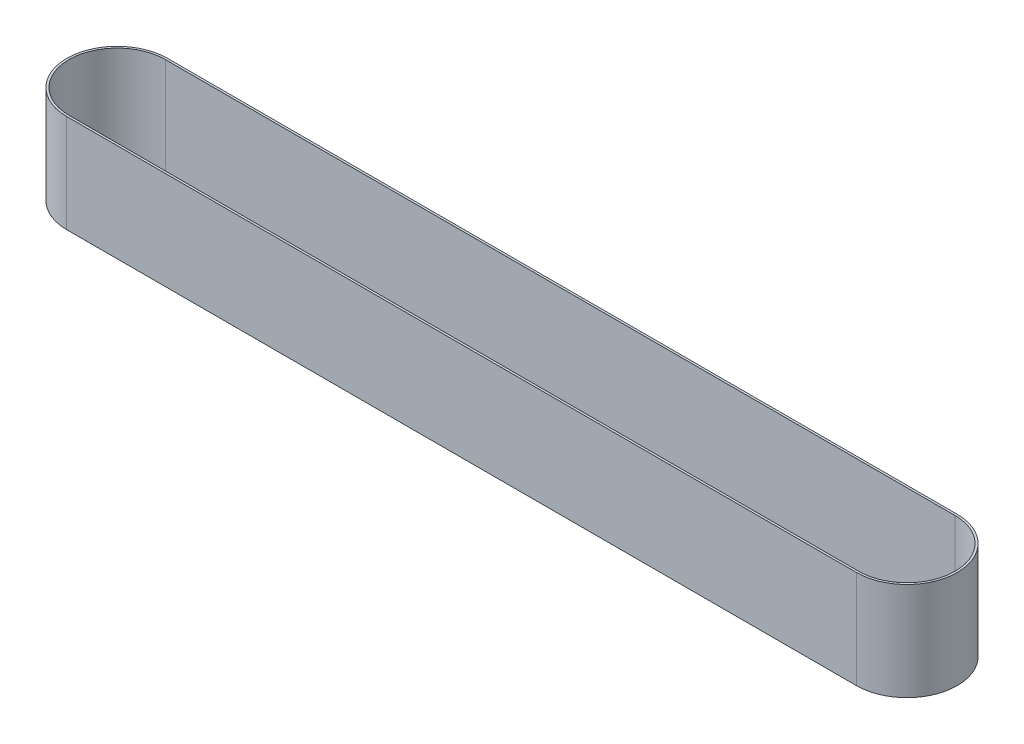
ISO-10303-21;
HEADER;
FILE_DESCRIPTION(('STEP AP214'),'2;1');
FILE_NAME('part.step','',(''),(''),'','','');
FILE_SCHEMA(('AUTOMOTIVE_DESIGN { 1 0 10303 214 1 1 1 1 }'));
ENDSEC;
DATA;
#1=APPLICATION_CONTEXT('core data for automotive mechanical design processes');
#2=APPLICATION_PROTOCOL_DEFINITION('international standard','automotive_design',2000,#1);
#3=PRODUCT_CONTEXT('',#1,'mechanical');
#4=PRODUCT('Part','Part','',(#3));
#5=PRODUCT_RELATED_PRODUCT_CATEGORY('part','',(#4));
#6=PRODUCT_DEFINITION_FORMATION('','',#4);
#7=PRODUCT_DEFINITION_CONTEXT('part definition',#1,'design');
#8=PRODUCT_DEFINITION('design','',#6,#7);
#9=PRODUCT_DEFINITION_SHAPE('','',#8);
#10=(LENGTH_UNIT() NAMED_UNIT(*) SI_UNIT(.MILLI.,.METRE.));
#11=(NAMED_UNIT(*) PLANE_ANGLE_UNIT() SI_UNIT($,.RADIAN.));
#12=(NAMED_UNIT(*) SI_UNIT($,.STERADIAN.) SOLID_ANGLE_UNIT());
#13=UNCERTAINTY_MEASURE_WITH_UNIT(LENGTH_MEASURE(1.E-05),#10,'distance_accuracy_value','');
#14=(GEOMETRIC_REPRESENTATION_CONTEXT(3) GLOBAL_UNCERTAINTY_ASSIGNED_CONTEXT((#13)) GLOBAL_UNIT_ASSIGNED_CONTEXT((#10,
#11,#12)) REPRESENTATION_CONTEXT('',''));
#15=CARTESIAN_POINT('',(0.,0.,0.));
#16=DIRECTION('',(0.,0.,1.));
#17=DIRECTION('',(1.,0.,0.));
#18=AXIS2_PLACEMENT_3D('',#15,#16,#17);
#19=CARTESIAN_POINT('',(0.,45.72,0.));
#20=DIRECTION('',(0.,1.,0.));
#21=DIRECTION('',(0.,0.,1.));
#22=AXIS2_PLACEMENT_3D('',#19,#20,#21);
#23=PLANE('',#22);
#24=CARTESIAN_POINT('',(0.,45.72,0.));
#25=DIRECTION('',(0.,1.,0.));
#26=DIRECTION('',(0.,0.,1.));
#27=AXIS2_PLACEMENT_3D('',#24,#25,#26);
#28=CIRCLE('',#27,23.5);
#29=CARTESIAN_POINT('',(0.,45.72,-23.5));
#30=VERTEX_POINT('',#29);
#31=CARTESIAN_POINT('',(0.,45.72,23.5));
#32=VERTEX_POINT('',#31);
#33=EDGE_CURVE('E134',#30,#32,#28,.T.);
#34=ORIENTED_EDGE('',*,*,#33,.T.);
#35=DIRECTION('',(1.,0.,0.));
#36=VECTOR('',#35,1.);
#37=CARTESIAN_POINT('',(0.,45.72,23.5));
#38=LINE('',#37,#36);
#39=CARTESIAN_POINT('',(368.3,45.72,23.5));
#40=VERTEX_POINT('',#39);
#41=EDGE_CURVE('E137',#32,#40,#38,.T.);
#42=ORIENTED_EDGE('',*,*,#41,.T.);
#43=CARTESIAN_POINT('',(368.3,45.72,0.));
#44=DIRECTION('',(0.,1.,0.));
#45=DIRECTION('',(0.,0.,1.));
#46=AXIS2_PLACEMENT_3D('',#43,#44,#45);
#47=CIRCLE('',#46,23.5);
#48=CARTESIAN_POINT('',(368.3,45.72,-23.5));
#49=VERTEX_POINT('',#48);
#50=EDGE_CURVE('E140',#40,#49,#47,.T.);
#51=ORIENTED_EDGE('',*,*,#50,.T.);
#52=DIRECTION('',(-1.,0.,0.));
#53=VECTOR('',#52,1.);
#54=CARTESIAN_POINT('',(0.,45.72,-23.5));
#55=LINE('',#54,#53);
#56=EDGE_CURVE('E142',#49,#30,#55,.T.);
#57=ORIENTED_EDGE('',*,*,#56,.T.);
#58=EDGE_LOOP('',(#34,#42,#51,#57));
#59=FACE_BOUND('',#58,.T.);
#60=DIRECTION('',(1.,0.,0.));
#61=VECTOR('',#60,1.);
#62=CARTESIAN_POINT('',(0.,45.72,22.5));
#63=LINE('',#62,#61);
#64=CARTESIAN_POINT('',(0.,45.72,22.5));
#65=VERTEX_POINT('',#64);
#66=CARTESIAN_POINT('',(368.3,45.72,22.5));
#67=VERTEX_POINT('',#66);
#68=EDGE_CURVE('E106',#65,#67,#63,.T.);
#69=ORIENTED_EDGE('',*,*,#68,.F.);
#70=CARTESIAN_POINT('',(0.,45.72,0.));
#71=DIRECTION('',(0.,1.,0.));
#72=DIRECTION('',(0.,0.,1.));
#73=AXIS2_PLACEMENT_3D('',#70,#71,#72);
#74=CIRCLE('',#73,22.5);
#75=CARTESIAN_POINT('',(0.,45.72,-22.5));
#76=VERTEX_POINT('',#75);
#77=EDGE_CURVE('E98',#76,#65,#74,.T.);
#78=ORIENTED_EDGE('',*,*,#77,.F.);
#79=DIRECTION('',(-1.,0.,0.));
#80=VECTOR('',#79,1.);
#81=CARTESIAN_POINT('',(0.,45.72,-22.5));
#82=LINE('',#81,#80);
#83=CARTESIAN_POINT('',(368.3,45.72,-22.5));
#84=VERTEX_POINT('',#83);
#85=EDGE_CURVE('E120',#84,#76,#82,.T.);
#86=ORIENTED_EDGE('',*,*,#85,.F.);
#87=CARTESIAN_POINT('',(368.3,45.72,0.));
#88=DIRECTION('',(0.,1.,0.));
#89=DIRECTION('',(0.,0.,1.));
#90=AXIS2_PLACEMENT_3D('',#87,#88,#89);
#91=CIRCLE('',#90,22.5);
#92=EDGE_CURVE('E118',#67,#84,#91,.T.);
#93=ORIENTED_EDGE('',*,*,#92,.F.);
#94=EDGE_LOOP('',(#69,#78,#86,#93));
#95=FACE_BOUND('',#94,.T.);
#96=ADVANCED_FACE('F33',(#59,#95),#23,.T.);
#97=CARTESIAN_POINT('',(0.,0.,0.));
#98=DIRECTION('',(0.,1.,0.));
#99=DIRECTION('',(0.,0.,1.));
#100=AXIS2_PLACEMENT_3D('',#97,#98,#99);
#101=PLANE('',#100);
#102=CARTESIAN_POINT('',(0.,0.,0.));
#103=DIRECTION('',(0.,1.,0.));
#104=DIRECTION('',(0.,0.,1.));
#105=AXIS2_PLACEMENT_3D('',#102,#103,#104);
#106=CIRCLE('',#105,23.5);
#107=CARTESIAN_POINT('',(0.,0.,-23.5));
#108=VERTEX_POINT('',#107);
#109=CARTESIAN_POINT('',(0.,0.,23.5));
#110=VERTEX_POINT('',#109);
#111=EDGE_CURVE('E114',#108,#110,#106,.T.);
#112=ORIENTED_EDGE('',*,*,#111,.F.);
#113=DIRECTION('',(-1.,0.,0.));
#114=VECTOR('',#113,1.);
#115=CARTESIAN_POINT('',(0.,0.,-23.5));
#116=LINE('',#115,#114);
#117=CARTESIAN_POINT('',(368.3,0.,-23.5));
#118=VERTEX_POINT('',#117);
#119=EDGE_CURVE('E138',#118,#108,#116,.T.);
#120=ORIENTED_EDGE('',*,*,#119,.F.);
#121=CARTESIAN_POINT('',(368.3,0.,0.));
#122=DIRECTION('',(0.,1.,0.));
#123=DIRECTION('',(0.,0.,1.));
#124=AXIS2_PLACEMENT_3D('',#121,#122,#123);
#125=CIRCLE('',#124,23.5);
#126=CARTESIAN_POINT('',(368.3,0.,23.5));
#127=VERTEX_POINT('',#126);
#128=EDGE_CURVE('E149',#127,#118,#125,.T.);
#129=ORIENTED_EDGE('',*,*,#128,.F.);
#130=DIRECTION('',(1.,0.,0.));
#131=VECTOR('',#130,1.);
#132=CARTESIAN_POINT('',(0.,0.,23.5));
#133=LINE('',#132,#131);
#134=EDGE_CURVE('E147',#110,#127,#133,.T.);
#135=ORIENTED_EDGE('',*,*,#134,.F.);
#136=EDGE_LOOP('',(#112,#120,#129,#135));
#137=FACE_BOUND('',#136,.T.);
#138=CARTESIAN_POINT('',(0.,0.,0.));
#139=DIRECTION('',(0.,1.,0.));
#140=DIRECTION('',(0.,0.,1.));
#141=AXIS2_PLACEMENT_3D('',#138,#139,#140);
#142=CIRCLE('',#141,22.5);
#143=CARTESIAN_POINT('',(0.,0.,-22.5));
#144=VERTEX_POINT('',#143);
#145=CARTESIAN_POINT('',(0.,0.,22.5));
#146=VERTEX_POINT('',#145);
#147=EDGE_CURVE('E56',#144,#146,#142,.T.);
#148=ORIENTED_EDGE('',*,*,#147,.T.);
#149=DIRECTION('',(1.,0.,0.));
#150=VECTOR('',#149,1.);
#151=CARTESIAN_POINT('',(0.,0.,22.5));
#152=LINE('',#151,#150);
#153=CARTESIAN_POINT('',(368.3,0.,22.5));
#154=VERTEX_POINT('',#153);
#155=EDGE_CURVE('E113',#146,#154,#152,.T.);
#156=ORIENTED_EDGE('',*,*,#155,.T.);
#157=CARTESIAN_POINT('',(368.3,0.,0.));
#158=DIRECTION('',(0.,1.,0.));
#159=DIRECTION('',(0.,0.,1.));
#160=AXIS2_PLACEMENT_3D('',#157,#158,#159);
#161=CIRCLE('',#160,22.5);
#162=CARTESIAN_POINT('',(368.3,0.,-22.5));
#163=VERTEX_POINT('',#162);
#164=EDGE_CURVE('E126',#154,#163,#161,.T.);
#165=ORIENTED_EDGE('',*,*,#164,.T.);
#166=DIRECTION('',(-1.,0.,0.));
#167=VECTOR('',#166,1.);
#168=CARTESIAN_POINT('',(0.,0.,-22.5));
#169=LINE('',#168,#167);
#170=EDGE_CURVE('E107',#163,#144,#169,.T.);
#171=ORIENTED_EDGE('',*,*,#170,.T.);
#172=EDGE_LOOP('',(#148,#156,#165,#171));
#173=FACE_BOUND('',#172,.T.);
#174=ADVANCED_FACE('F167',(#137,#173),#101,.F.);
#175=CARTESIAN_POINT('',(0.,45.72,0.));
#176=DIRECTION('',(0.,-1.,0.));
#177=DIRECTION('',(0.,0.,-1.));
#178=AXIS2_PLACEMENT_3D('',#175,#176,#177);
#179=CYLINDRICAL_SURFACE('',#178,23.5);
#180=ORIENTED_EDGE('',*,*,#111,.T.);
#181=DIRECTION('',(0.,-1.,0.));
#182=VECTOR('',#181,1.);
#183=CARTESIAN_POINT('',(0.,45.72,23.5));
#184=LINE('',#183,#182);
#185=EDGE_CURVE('E11',#32,#110,#184,.T.);
#186=ORIENTED_EDGE('',*,*,#185,.F.);
#187=ORIENTED_EDGE('',*,*,#33,.F.);
#188=DIRECTION('',(0.,-1.,0.));
#189=VECTOR('',#188,1.);
#190=CARTESIAN_POINT('',(0.,45.72,-23.5));
#191=LINE('',#190,#189);
#192=EDGE_CURVE('E144',#30,#108,#191,.T.);
#193=ORIENTED_EDGE('',*,*,#192,.T.);
#194=EDGE_LOOP('',(#180,#186,#187,#193));
#195=FACE_BOUND('',#194,.T.);
#196=ADVANCED_FACE('F35',(#195),#179,.T.);
#197=CARTESIAN_POINT('',(0.,45.72,23.5));
#198=DIRECTION('',(0.,0.,-1.));
#199=DIRECTION('',(-1.,0.,0.));
#200=AXIS2_PLACEMENT_3D('',#197,#198,#199);
#201=PLANE('',#200);
#202=ORIENTED_EDGE('',*,*,#134,.T.);
#203=DIRECTION('',(0.,-1.,0.));
#204=VECTOR('',#203,1.);
#205=CARTESIAN_POINT('',(368.3,45.72,23.5));
#206=LINE('',#205,#204);
#207=EDGE_CURVE('E41',#40,#127,#206,.T.);
#208=ORIENTED_EDGE('',*,*,#207,.F.);
#209=ORIENTED_EDGE('',*,*,#41,.F.);
#210=ORIENTED_EDGE('',*,*,#185,.T.);
#211=EDGE_LOOP('',(#202,#208,#209,#210));
#212=FACE_BOUND('',#211,.T.);
#213=ADVANCED_FACE('F177',(#212),#201,.F.);
#214=CARTESIAN_POINT('',(368.3,45.72,0.));
#215=DIRECTION('',(0.,-1.,0.));
#216=DIRECTION('',(0.,0.,-1.));
#217=AXIS2_PLACEMENT_3D('',#214,#215,#216);
#218=CYLINDRICAL_SURFACE('',#217,23.5);
#219=ORIENTED_EDGE('',*,*,#128,.T.);
#220=DIRECTION('',(0.,-1.,0.));
#221=VECTOR('',#220,1.);
#222=CARTESIAN_POINT('',(368.3,45.72,-23.5));
#223=LINE('',#222,#221);
#224=EDGE_CURVE('E154',#49,#118,#223,.T.);
#225=ORIENTED_EDGE('',*,*,#224,.F.);
#226=ORIENTED_EDGE('',*,*,#50,.F.);
#227=ORIENTED_EDGE('',*,*,#207,.T.);
#228=EDGE_LOOP('',(#219,#225,#226,#227));
#229=FACE_BOUND('',#228,.T.);
#230=ADVANCED_FACE('F161',(#229),#218,.T.);
#231=CARTESIAN_POINT('',(0.,45.72,-23.5));
#232=DIRECTION('',(0.,0.,1.));
#233=DIRECTION('',(1.,0.,0.));
#234=AXIS2_PLACEMENT_3D('',#231,#232,#233);
#235=PLANE('',#234);
#236=ORIENTED_EDGE('',*,*,#119,.T.);
#237=ORIENTED_EDGE('',*,*,#192,.F.);
#238=ORIENTED_EDGE('',*,*,#56,.F.);
#239=ORIENTED_EDGE('',*,*,#224,.T.);
#240=EDGE_LOOP('',(#236,#237,#238,#239));
#241=FACE_BOUND('',#240,.T.);
#242=ADVANCED_FACE('F171',(#241),#235,.F.);
#243=CARTESIAN_POINT('',(0.,45.72,0.));
#244=DIRECTION('',(0.,-1.,0.));
#245=DIRECTION('',(0.,0.,-1.));
#246=AXIS2_PLACEMENT_3D('',#243,#244,#245);
#247=CYLINDRICAL_SURFACE('',#246,22.5);
#248=ORIENTED_EDGE('',*,*,#147,.F.);
#249=DIRECTION('',(0.,-1.,0.));
#250=VECTOR('',#249,1.);
#251=CARTESIAN_POINT('',(0.,45.72,-22.5));
#252=LINE('',#251,#250);
#253=EDGE_CURVE('E102',#76,#144,#252,.T.);
#254=ORIENTED_EDGE('',*,*,#253,.F.);
#255=ORIENTED_EDGE('',*,*,#77,.T.);
#256=DIRECTION('',(0.,-1.,0.));
#257=VECTOR('',#256,1.);
#258=CARTESIAN_POINT('',(0.,45.72,22.5));
#259=LINE('',#258,#257);
#260=EDGE_CURVE('E101',#65,#146,#259,.T.);
#261=ORIENTED_EDGE('',*,*,#260,.T.);
#262=EDGE_LOOP('',(#248,#254,#255,#261));
#263=FACE_BOUND('',#262,.T.);
#264=ADVANCED_FACE('F100',(#263),#247,.F.);
#265=CARTESIAN_POINT('',(0.,45.72,22.5));
#266=DIRECTION('',(0.,0.,-1.));
#267=DIRECTION('',(-1.,0.,0.));
#268=AXIS2_PLACEMENT_3D('',#265,#266,#267);
#269=PLANE('',#268);
#270=ORIENTED_EDGE('',*,*,#155,.F.);
#271=ORIENTED_EDGE('',*,*,#260,.F.);
#272=ORIENTED_EDGE('',*,*,#68,.T.);
#273=DIRECTION('',(0.,-1.,0.));
#274=VECTOR('',#273,1.);
#275=CARTESIAN_POINT('',(368.3,45.72,22.5));
#276=LINE('',#275,#274);
#277=EDGE_CURVE('E115',#67,#154,#276,.T.);
#278=ORIENTED_EDGE('',*,*,#277,.T.);
#279=EDGE_LOOP('',(#270,#271,#272,#278));
#280=FACE_BOUND('',#279,.T.);
#281=ADVANCED_FACE('F110',(#280),#269,.T.);
#282=CARTESIAN_POINT('',(368.3,45.72,0.));
#283=DIRECTION('',(0.,-1.,0.));
#284=DIRECTION('',(0.,0.,-1.));
#285=AXIS2_PLACEMENT_3D('',#282,#283,#284);
#286=CYLINDRICAL_SURFACE('',#285,22.5);
#287=ORIENTED_EDGE('',*,*,#164,.F.);
#288=ORIENTED_EDGE('',*,*,#277,.F.);
#289=ORIENTED_EDGE('',*,*,#92,.T.);
#290=DIRECTION('',(0.,-1.,0.));
#291=VECTOR('',#290,1.);
#292=CARTESIAN_POINT('',(368.3,45.72,-22.5));
#293=LINE('',#292,#291);
#294=EDGE_CURVE('E48',#84,#163,#293,.T.);
#295=ORIENTED_EDGE('',*,*,#294,.T.);
#296=EDGE_LOOP('',(#287,#288,#289,#295));
#297=FACE_BOUND('',#296,.T.);
#298=ADVANCED_FACE('F200',(#297),#286,.F.);
#299=CARTESIAN_POINT('',(0.,45.72,-22.5));
#300=DIRECTION('',(0.,0.,1.));
#301=DIRECTION('',(1.,0.,0.));
#302=AXIS2_PLACEMENT_3D('',#299,#300,#301);
#303=PLANE('',#302);
#304=ORIENTED_EDGE('',*,*,#170,.F.);
#305=ORIENTED_EDGE('',*,*,#294,.F.);
#306=ORIENTED_EDGE('',*,*,#85,.T.);
#307=ORIENTED_EDGE('',*,*,#253,.T.);
#308=EDGE_LOOP('',(#304,#305,#306,#307));
#309=FACE_BOUND('',#308,.T.);
#310=ADVANCED_FACE('F204',(#309),#303,.T.);
#311=CLOSED_SHELL('',(#96,#174,#196,#213,#230,#242,#264,#281,#298,#310));
#312=MANIFOLD_SOLID_BREP('B2',#311);
#313=ADVANCED_BREP_SHAPE_REPRESENTATION('',(#18,#312),#14);
#314=SHAPE_DEFINITION_REPRESENTATION(#9,#313);
ENDSEC;
END-ISO-10303-21;
